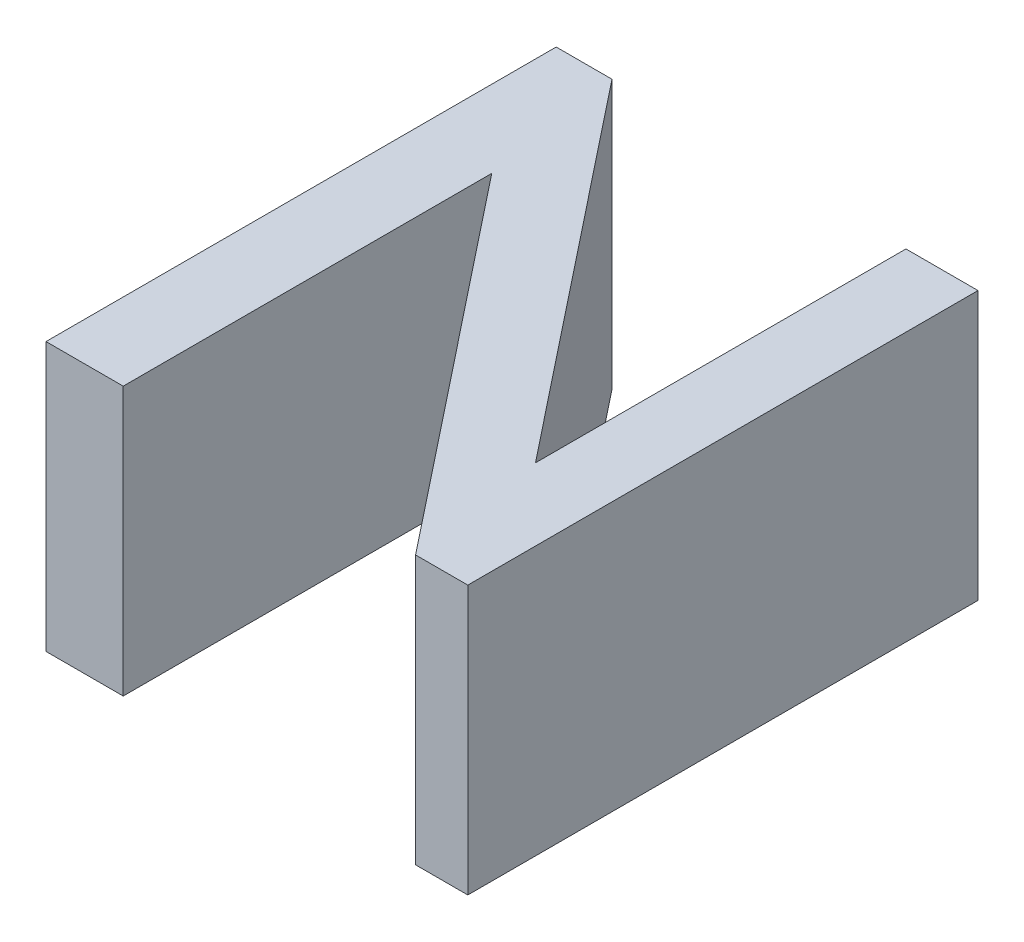
ISO-10303-21;
HEADER;
FILE_DESCRIPTION(('STEP AP214'),'2;1');
FILE_NAME('part.step','',(''),(''),'','','');
FILE_SCHEMA(('AUTOMOTIVE_DESIGN { 1 0 10303 214 1 1 1 1 }'));
ENDSEC;
DATA;
#1=APPLICATION_CONTEXT('core data for automotive mechanical design processes');
#2=APPLICATION_PROTOCOL_DEFINITION('international standard','automotive_design',2000,#1);
#3=PRODUCT_CONTEXT('',#1,'mechanical');
#4=PRODUCT('Part','Part','',(#3));
#5=PRODUCT_RELATED_PRODUCT_CATEGORY('part','',(#4));
#6=PRODUCT_DEFINITION_FORMATION('','',#4);
#7=PRODUCT_DEFINITION_CONTEXT('part definition',#1,'design');
#8=PRODUCT_DEFINITION('design','',#6,#7);
#9=PRODUCT_DEFINITION_SHAPE('','',#8);
#10=(LENGTH_UNIT() NAMED_UNIT(*) SI_UNIT(.MILLI.,.METRE.));
#11=(NAMED_UNIT(*) PLANE_ANGLE_UNIT() SI_UNIT($,.RADIAN.));
#12=(NAMED_UNIT(*) SI_UNIT($,.STERADIAN.) SOLID_ANGLE_UNIT());
#13=UNCERTAINTY_MEASURE_WITH_UNIT(LENGTH_MEASURE(1.E-05),#10,'distance_accuracy_value','');
#14=(GEOMETRIC_REPRESENTATION_CONTEXT(3) GLOBAL_UNCERTAINTY_ASSIGNED_CONTEXT((#13)) GLOBAL_UNIT_ASSIGNED_CONTEXT((#10,
#11,#12)) REPRESENTATION_CONTEXT('',''));
#15=CARTESIAN_POINT('',(0.,0.,0.));
#16=DIRECTION('',(0.,0.,1.));
#17=DIRECTION('',(1.,0.,0.));
#18=AXIS2_PLACEMENT_3D('',#15,#16,#17);
#19=CARTESIAN_POINT('',(152.750196360401,10.,-56.28859622837));
#20=DIRECTION('',(0.,0.,-1.));
#21=DIRECTION('',(-1.,0.,0.));
#22=AXIS2_PLACEMENT_3D('',#19,#20,#21);
#23=PLANE('',#22);
#24=DIRECTION('',(1.,0.,0.));
#25=VECTOR('',#24,1.);
#26=CARTESIAN_POINT('',(152.750196360401,0.,-56.28859622837));
#27=LINE('',#26,#25);
#28=CARTESIAN_POINT('',(149.872942193578,0.,-56.28859622837));
#29=VERTEX_POINT('',#28);
#30=CARTESIAN_POINT('',(152.750196360401,0.,-56.28859622837));
#31=VERTEX_POINT('',#30);
#32=EDGE_CURVE('E138',#29,#31,#27,.T.);
#33=ORIENTED_EDGE('',*,*,#32,.T.);
#34=DIRECTION('',(0.,-1.,0.));
#35=VECTOR('',#34,1.);
#36=CARTESIAN_POINT('',(152.750196360401,10.,-56.28859622837));
#37=LINE('',#36,#35);
#38=CARTESIAN_POINT('',(152.750196360401,10.,-56.28859622837));
#39=VERTEX_POINT('',#38);
#40=EDGE_CURVE('E11',#39,#31,#37,.T.);
#41=ORIENTED_EDGE('',*,*,#40,.F.);
#42=DIRECTION('',(1.,0.,0.));
#43=VECTOR('',#42,1.);
#44=CARTESIAN_POINT('',(152.750196360401,10.,-56.28859622837));
#45=LINE('',#44,#43);
#46=CARTESIAN_POINT('',(149.872942193578,10.,-56.28859622837));
#47=VERTEX_POINT('',#46);
#48=EDGE_CURVE('E156',#47,#39,#45,.T.);
#49=ORIENTED_EDGE('',*,*,#48,.F.);
#50=DIRECTION('',(0.,-1.,0.));
#51=VECTOR('',#50,1.);
#52=CARTESIAN_POINT('',(149.872942193578,10.,-56.28859622837));
#53=LINE('',#52,#51);
#54=EDGE_CURVE('E134',#47,#29,#53,.T.);
#55=ORIENTED_EDGE('',*,*,#54,.T.);
#56=EDGE_LOOP('',(#33,#41,#49,#55));
#57=FACE_BOUND('',#56,.T.);
#58=ADVANCED_FACE('F30',(#57),#23,.F.);
#59=CARTESIAN_POINT('',(152.750196360401,10.,-70.0192436771193));
#60=DIRECTION('',(-1.,0.,0.));
#61=DIRECTION('',(0.,0.,1.));
#62=AXIS2_PLACEMENT_3D('',#59,#60,#61);
#63=PLANE('',#62);
#64=DIRECTION('',(0.,0.,-1.));
#65=VECTOR('',#64,1.);
#66=CARTESIAN_POINT('',(152.750196360401,0.,-70.0192436771193));
#67=LINE('',#66,#65);
#68=CARTESIAN_POINT('',(152.750196360401,0.,-70.0192436771193));
#69=VERTEX_POINT('',#68);
#70=EDGE_CURVE('E141',#31,#69,#67,.T.);
#71=ORIENTED_EDGE('',*,*,#70,.T.);
#72=DIRECTION('',(0.,-1.,0.));
#73=VECTOR('',#72,1.);
#74=CARTESIAN_POINT('',(152.750196360401,10.,-70.0192436771193));
#75=LINE('',#74,#73);
#76=CARTESIAN_POINT('',(152.750196360401,10.,-70.0192436771193));
#77=VERTEX_POINT('',#76);
#78=EDGE_CURVE('E38',#77,#69,#75,.T.);
#79=ORIENTED_EDGE('',*,*,#78,.F.);
#80=DIRECTION('',(0.,0.,-1.));
#81=VECTOR('',#80,1.);
#82=CARTESIAN_POINT('',(152.750196360401,10.,-70.0192436771193));
#83=LINE('',#82,#81);
#84=EDGE_CURVE('E95',#39,#77,#83,.T.);
#85=ORIENTED_EDGE('',*,*,#84,.F.);
#86=ORIENTED_EDGE('',*,*,#40,.T.);
#87=EDGE_LOOP('',(#71,#79,#85,#86));
#88=FACE_BOUND('',#87,.T.);
#89=ADVANCED_FACE('F205',(#88),#63,.F.);
#90=CARTESIAN_POINT('',(163.643854133013,10.,-56.28859622837));
#91=DIRECTION('',(0.783391170539882,0.,-0.621528980756452));
#92=DIRECTION('',(-0.621528980756452,0.,-0.783391170539882));
#93=AXIS2_PLACEMENT_3D('',#90,#91,#92);
#94=PLANE('',#93);
#95=DIRECTION('',(0.621528980756452,0.,0.783391170539882));
#96=VECTOR('',#95,1.);
#97=CARTESIAN_POINT('',(163.643854133013,0.,-56.28859622837));
#98=LINE('',#97,#96);
#99=CARTESIAN_POINT('',(163.643854133013,0.,-56.28859622837));
#100=VERTEX_POINT('',#99);
#101=EDGE_CURVE('E143',#69,#100,#98,.T.);
#102=ORIENTED_EDGE('',*,*,#101,.T.);
#103=DIRECTION('',(0.,-1.,0.));
#104=VECTOR('',#103,1.);
#105=CARTESIAN_POINT('',(163.643854133013,10.,-56.28859622837));
#106=LINE('',#105,#104);
#107=CARTESIAN_POINT('',(163.643854133013,10.,-56.28859622837));
#108=VERTEX_POINT('',#107);
#109=EDGE_CURVE('E169',#108,#100,#106,.T.);
#110=ORIENTED_EDGE('',*,*,#109,.F.);
#111=DIRECTION('',(0.621528980756452,0.,0.783391170539882));
#112=VECTOR('',#111,1.);
#113=CARTESIAN_POINT('',(163.643854133013,10.,-56.28859622837));
#114=LINE('',#113,#112);
#115=EDGE_CURVE('E177',#77,#108,#114,.T.);
#116=ORIENTED_EDGE('',*,*,#115,.F.);
#117=ORIENTED_EDGE('',*,*,#78,.T.);
#118=EDGE_LOOP('',(#102,#110,#116,#117));
#119=FACE_BOUND('',#118,.T.);
#120=ADVANCED_FACE('F175',(#119),#94,.F.);
#121=CARTESIAN_POINT('',(165.588889592896,10.,-56.28859622837));
#122=DIRECTION('',(0.,0.,-1.));
#123=DIRECTION('',(-1.,0.,0.));
#124=AXIS2_PLACEMENT_3D('',#121,#122,#123);
#125=PLANE('',#124);
#126=DIRECTION('',(1.,0.,0.));
#127=VECTOR('',#126,1.);
#128=CARTESIAN_POINT('',(165.588889592896,0.,-56.28859622837));
#129=LINE('',#128,#127);
#130=CARTESIAN_POINT('',(165.588889592896,0.,-56.28859622837));
#131=VERTEX_POINT('',#130);
#132=EDGE_CURVE('E145',#100,#131,#129,.T.);
#133=ORIENTED_EDGE('',*,*,#132,.T.);
#134=DIRECTION('',(0.,-1.,0.));
#135=VECTOR('',#134,1.);
#136=CARTESIAN_POINT('',(165.588889592896,10.,-56.28859622837));
#137=LINE('',#136,#135);
#138=CARTESIAN_POINT('',(165.588889592896,10.,-56.28859622837));
#139=VERTEX_POINT('',#138);
#140=EDGE_CURVE('E166',#139,#131,#137,.T.);
#141=ORIENTED_EDGE('',*,*,#140,.F.);
#142=DIRECTION('',(1.,0.,0.));
#143=VECTOR('',#142,1.);
#144=CARTESIAN_POINT('',(165.588889592896,10.,-56.28859622837));
#145=LINE('',#144,#143);
#146=EDGE_CURVE('E195',#108,#139,#145,.T.);
#147=ORIENTED_EDGE('',*,*,#146,.F.);
#148=ORIENTED_EDGE('',*,*,#109,.T.);
#149=EDGE_LOOP('',(#133,#141,#147,#148));
#150=FACE_BOUND('',#149,.T.);
#151=ADVANCED_FACE('F186',(#150),#125,.F.);
#152=CARTESIAN_POINT('',(165.588889592896,10.,-75.2974570796293));
#153=DIRECTION('',(-1.,0.,0.));
#154=DIRECTION('',(0.,0.,1.));
#155=AXIS2_PLACEMENT_3D('',#152,#153,#154);
#156=PLANE('',#155);
#157=DIRECTION('',(0.,0.,-1.));
#158=VECTOR('',#157,1.);
#159=CARTESIAN_POINT('',(165.588889592896,0.,-75.2974570796293));
#160=LINE('',#159,#158);
#161=CARTESIAN_POINT('',(165.588889592896,0.,-75.2974570796293));
#162=VERTEX_POINT('',#161);
#163=EDGE_CURVE('E147',#131,#162,#160,.T.);
#164=ORIENTED_EDGE('',*,*,#163,.T.);
#165=DIRECTION('',(0.,-1.,0.));
#166=VECTOR('',#165,1.);
#167=CARTESIAN_POINT('',(165.588889592896,10.,-75.2974570796293));
#168=LINE('',#167,#166);
#169=CARTESIAN_POINT('',(165.588889592896,10.,-75.2974570796293));
#170=VERTEX_POINT('',#169);
#171=EDGE_CURVE('E163',#170,#162,#168,.T.);
#172=ORIENTED_EDGE('',*,*,#171,.F.);
#173=DIRECTION('',(0.,0.,-1.));
#174=VECTOR('',#173,1.);
#175=CARTESIAN_POINT('',(165.588889592896,10.,-75.2974570796293));
#176=LINE('',#175,#174);
#177=EDGE_CURVE('E192',#139,#170,#176,.T.);
#178=ORIENTED_EDGE('',*,*,#177,.F.);
#179=ORIENTED_EDGE('',*,*,#140,.T.);
#180=EDGE_LOOP('',(#164,#172,#178,#179));
#181=FACE_BOUND('',#180,.T.);
#182=ADVANCED_FACE('F190',(#181),#156,.F.);
#183=CARTESIAN_POINT('',(162.904476310761,10.,-75.2974570796293));
#184=DIRECTION('',(0.,0.,1.));
#185=DIRECTION('',(1.,0.,0.));
#186=AXIS2_PLACEMENT_3D('',#183,#184,#185);
#187=PLANE('',#186);
#188=DIRECTION('',(-1.,0.,0.));
#189=VECTOR('',#188,1.);
#190=CARTESIAN_POINT('',(162.904476310761,0.,-75.2974570796293));
#191=LINE('',#190,#189);
#192=CARTESIAN_POINT('',(162.904476310761,0.,-75.2974570796293));
#193=VERTEX_POINT('',#192);
#194=EDGE_CURVE('E149',#162,#193,#191,.T.);
#195=ORIENTED_EDGE('',*,*,#194,.T.);
#196=DIRECTION('',(0.,-1.,0.));
#197=VECTOR('',#196,1.);
#198=CARTESIAN_POINT('',(162.904476310761,10.,-75.2974570796293));
#199=LINE('',#198,#197);
#200=CARTESIAN_POINT('',(162.904476310761,10.,-75.2974570796293));
#201=VERTEX_POINT('',#200);
#202=EDGE_CURVE('E160',#201,#193,#199,.T.);
#203=ORIENTED_EDGE('',*,*,#202,.F.);
#204=DIRECTION('',(-1.,0.,0.));
#205=VECTOR('',#204,1.);
#206=CARTESIAN_POINT('',(162.904476310761,10.,-75.2974570796293));
#207=LINE('',#206,#205);
#208=EDGE_CURVE('E194',#170,#201,#207,.T.);
#209=ORIENTED_EDGE('',*,*,#208,.F.);
#210=ORIENTED_EDGE('',*,*,#171,.T.);
#211=EDGE_LOOP('',(#195,#203,#209,#210));
#212=FACE_BOUND('',#211,.T.);
#213=ADVANCED_FACE('F217',(#212),#187,.F.);
#214=CARTESIAN_POINT('',(162.904476310761,10.,-61.4932307370017));
#215=DIRECTION('',(1.,0.,0.));
#216=DIRECTION('',(0.,0.,-1.));
#217=AXIS2_PLACEMENT_3D('',#214,#215,#216);
#218=PLANE('',#217);
#219=DIRECTION('',(0.,0.,1.));
#220=VECTOR('',#219,1.);
#221=CARTESIAN_POINT('',(162.904476310761,0.,-61.4932307370017));
#222=LINE('',#221,#220);
#223=CARTESIAN_POINT('',(162.904476310761,0.,-61.4932307370017));
#224=VERTEX_POINT('',#223);
#225=EDGE_CURVE('E151',#193,#224,#222,.T.);
#226=ORIENTED_EDGE('',*,*,#225,.T.);
#227=DIRECTION('',(0.,-1.,0.));
#228=VECTOR('',#227,1.);
#229=CARTESIAN_POINT('',(162.904476310761,10.,-61.4932307370017));
#230=LINE('',#229,#228);
#231=CARTESIAN_POINT('',(162.904476310761,10.,-61.4932307370017));
#232=VERTEX_POINT('',#231);
#233=EDGE_CURVE('E129',#232,#224,#230,.T.);
#234=ORIENTED_EDGE('',*,*,#233,.F.);
#235=DIRECTION('',(0.,0.,1.));
#236=VECTOR('',#235,1.);
#237=CARTESIAN_POINT('',(162.904476310761,10.,-61.4932307370017));
#238=LINE('',#237,#236);
#239=EDGE_CURVE('E120',#201,#232,#238,.T.);
#240=ORIENTED_EDGE('',*,*,#239,.F.);
#241=ORIENTED_EDGE('',*,*,#202,.T.);
#242=EDGE_LOOP('',(#226,#234,#240,#241));
#243=FACE_BOUND('',#242,.T.);
#244=ADVANCED_FACE('F220',(#243),#218,.F.);
#245=CARTESIAN_POINT('',(151.95244231866,10.,-75.2974570796293));
#246=DIRECTION('',(-0.783391170539881,0.,0.621528980756452));
#247=DIRECTION('',(0.621528980756452,0.,0.783391170539881));
#248=AXIS2_PLACEMENT_3D('',#245,#246,#247);
#249=PLANE('',#248);
#250=DIRECTION('',(-0.621528980756452,0.,-0.783391170539881));
#251=VECTOR('',#250,1.);
#252=CARTESIAN_POINT('',(151.95244231866,0.,-75.2974570796293));
#253=LINE('',#252,#251);
#254=CARTESIAN_POINT('',(151.95244231866,0.,-75.2974570796293));
#255=VERTEX_POINT('',#254);
#256=EDGE_CURVE('E128',#224,#255,#253,.T.);
#257=ORIENTED_EDGE('',*,*,#256,.T.);
#258=DIRECTION('',(0.,-1.,0.));
#259=VECTOR('',#258,1.);
#260=CARTESIAN_POINT('',(151.95244231866,10.,-75.2974570796293));
#261=LINE('',#260,#259);
#262=CARTESIAN_POINT('',(151.95244231866,10.,-75.2974570796293));
#263=VERTEX_POINT('',#262);
#264=EDGE_CURVE('E125',#263,#255,#261,.T.);
#265=ORIENTED_EDGE('',*,*,#264,.F.);
#266=DIRECTION('',(-0.621528980756452,0.,-0.783391170539881));
#267=VECTOR('',#266,1.);
#268=CARTESIAN_POINT('',(151.95244231866,10.,-75.2974570796293));
#269=LINE('',#268,#267);
#270=EDGE_CURVE('E114',#232,#263,#269,.T.);
#271=ORIENTED_EDGE('',*,*,#270,.F.);
#272=ORIENTED_EDGE('',*,*,#233,.T.);
#273=EDGE_LOOP('',(#257,#265,#271,#272));
#274=FACE_BOUND('',#273,.T.);
#275=ADVANCED_FACE('F126',(#274),#249,.F.);
#276=CARTESIAN_POINT('',(149.872942193578,10.,-75.2974570796293));
#277=DIRECTION('',(0.,0.,1.));
#278=DIRECTION('',(1.,0.,0.));
#279=AXIS2_PLACEMENT_3D('',#276,#277,#278);
#280=PLANE('',#279);
#281=DIRECTION('',(-1.,0.,0.));
#282=VECTOR('',#281,1.);
#283=CARTESIAN_POINT('',(149.872942193578,0.,-75.2974570796293));
#284=LINE('',#283,#282);
#285=CARTESIAN_POINT('',(149.872942193578,0.,-75.2974570796293));
#286=VERTEX_POINT('',#285);
#287=EDGE_CURVE('E81',#255,#286,#284,.T.);
#288=ORIENTED_EDGE('',*,*,#287,.T.);
#289=DIRECTION('',(0.,-1.,0.));
#290=VECTOR('',#289,1.);
#291=CARTESIAN_POINT('',(149.872942193578,10.,-75.2974570796293));
#292=LINE('',#291,#290);
#293=CARTESIAN_POINT('',(149.872942193578,10.,-75.2974570796293));
#294=VERTEX_POINT('',#293);
#295=EDGE_CURVE('E130',#294,#286,#292,.T.);
#296=ORIENTED_EDGE('',*,*,#295,.F.);
#297=DIRECTION('',(-1.,0.,0.));
#298=VECTOR('',#297,1.);
#299=CARTESIAN_POINT('',(149.872942193578,10.,-75.2974570796293));
#300=LINE('',#299,#298);
#301=EDGE_CURVE('E118',#263,#294,#300,.T.);
#302=ORIENTED_EDGE('',*,*,#301,.F.);
#303=ORIENTED_EDGE('',*,*,#264,.T.);
#304=EDGE_LOOP('',(#288,#296,#302,#303));
#305=FACE_BOUND('',#304,.T.);
#306=ADVANCED_FACE('F132',(#305),#280,.F.);
#307=CARTESIAN_POINT('',(149.872942193578,10.,-56.28859622837));
#308=DIRECTION('',(1.,0.,0.));
#309=DIRECTION('',(0.,0.,-1.));
#310=AXIS2_PLACEMENT_3D('',#307,#308,#309);
#311=PLANE('',#310);
#312=DIRECTION('',(0.,0.,1.));
#313=VECTOR('',#312,1.);
#314=CARTESIAN_POINT('',(149.872942193578,0.,-56.28859622837));
#315=LINE('',#314,#313);
#316=EDGE_CURVE('E87',#286,#29,#315,.T.);
#317=ORIENTED_EDGE('',*,*,#316,.T.);
#318=ORIENTED_EDGE('',*,*,#54,.F.);
#319=DIRECTION('',(0.,0.,1.));
#320=VECTOR('',#319,1.);
#321=CARTESIAN_POINT('',(149.872942193578,10.,-56.28859622837));
#322=LINE('',#321,#320);
#323=EDGE_CURVE('E46',#294,#47,#322,.T.);
#324=ORIENTED_EDGE('',*,*,#323,.F.);
#325=ORIENTED_EDGE('',*,*,#295,.T.);
#326=EDGE_LOOP('',(#317,#318,#324,#325));
#327=FACE_BOUND('',#326,.T.);
#328=ADVANCED_FACE('F229',(#327),#311,.F.);
#329=CARTESIAN_POINT('',(0.,10.,0.));
#330=DIRECTION('',(0.,-1.,0.));
#331=DIRECTION('',(0.,0.,-1.));
#332=AXIS2_PLACEMENT_3D('',#329,#330,#331);
#333=PLANE('',#332);
#334=ORIENTED_EDGE('',*,*,#48,.T.);
#335=ORIENTED_EDGE('',*,*,#84,.T.);
#336=ORIENTED_EDGE('',*,*,#115,.T.);
#337=ORIENTED_EDGE('',*,*,#146,.T.);
#338=ORIENTED_EDGE('',*,*,#177,.T.);
#339=ORIENTED_EDGE('',*,*,#208,.T.);
#340=ORIENTED_EDGE('',*,*,#239,.T.);
#341=ORIENTED_EDGE('',*,*,#270,.T.);
#342=ORIENTED_EDGE('',*,*,#301,.T.);
#343=ORIENTED_EDGE('',*,*,#323,.T.);
#344=EDGE_LOOP('',(#334,#335,#336,#337,#338,#339,#340,#341,#342,#343));
#345=FACE_BOUND('',#344,.T.);
#346=ADVANCED_FACE('F116',(#345),#333,.F.);
#347=CARTESIAN_POINT('',(0.,0.,0.));
#348=DIRECTION('',(0.,-1.,0.));
#349=DIRECTION('',(0.,0.,-1.));
#350=AXIS2_PLACEMENT_3D('',#347,#348,#349);
#351=PLANE('',#350);
#352=ORIENTED_EDGE('',*,*,#32,.F.);
#353=ORIENTED_EDGE('',*,*,#316,.F.);
#354=ORIENTED_EDGE('',*,*,#287,.F.);
#355=ORIENTED_EDGE('',*,*,#256,.F.);
#356=ORIENTED_EDGE('',*,*,#225,.F.);
#357=ORIENTED_EDGE('',*,*,#194,.F.);
#358=ORIENTED_EDGE('',*,*,#163,.F.);
#359=ORIENTED_EDGE('',*,*,#132,.F.);
#360=ORIENTED_EDGE('',*,*,#101,.F.);
#361=ORIENTED_EDGE('',*,*,#70,.F.);
#362=EDGE_LOOP('',(#352,#353,#354,#355,#356,#357,#358,#359,#360,#361));
#363=FACE_BOUND('',#362,.T.);
#364=ADVANCED_FACE('F181',(#363),#351,.T.);
#365=CLOSED_SHELL('',(#58,#89,#120,#151,#182,#213,#244,#275,#306,#328,#346,#364));
#366=MANIFOLD_SOLID_BREP('B2',#365);
#367=ADVANCED_BREP_SHAPE_REPRESENTATION('',(#18,#366),#14);
#368=SHAPE_DEFINITION_REPRESENTATION(#9,#367);
ENDSEC;
END-ISO-10303-21;
